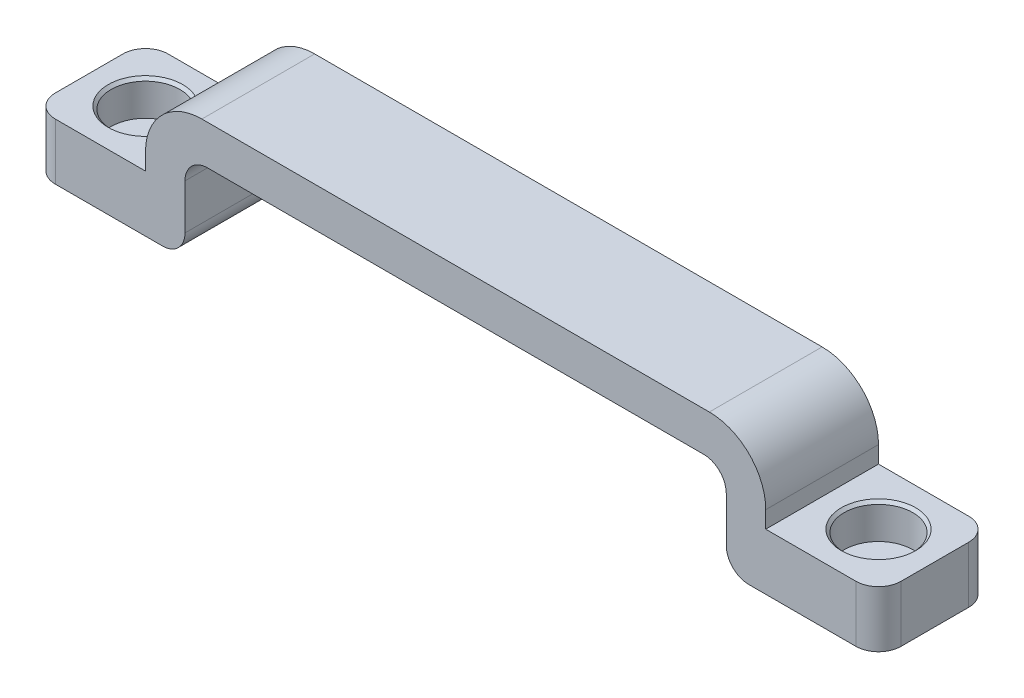
ISO-10303-21;
HEADER;
FILE_DESCRIPTION(('STEP AP214'),'2;1');
FILE_NAME('part.step','',(''),(''),'','','');
FILE_SCHEMA(('AUTOMOTIVE_DESIGN { 1 0 10303 214 1 1 1 1 }'));
ENDSEC;
DATA;
#1=APPLICATION_CONTEXT('core data for automotive mechanical design processes');
#2=APPLICATION_PROTOCOL_DEFINITION('international standard','automotive_design',2000,#1);
#3=PRODUCT_CONTEXT('',#1,'mechanical');
#4=PRODUCT('Part','Part','',(#3));
#5=PRODUCT_RELATED_PRODUCT_CATEGORY('part','',(#4));
#6=PRODUCT_DEFINITION_FORMATION('','',#4);
#7=PRODUCT_DEFINITION_CONTEXT('part definition',#1,'design');
#8=PRODUCT_DEFINITION('design','',#6,#7);
#9=PRODUCT_DEFINITION_SHAPE('','',#8);
#10=(LENGTH_UNIT() NAMED_UNIT(*) SI_UNIT(.MILLI.,.METRE.));
#11=(NAMED_UNIT(*) PLANE_ANGLE_UNIT() SI_UNIT($,.RADIAN.));
#12=(NAMED_UNIT(*) SI_UNIT($,.STERADIAN.) SOLID_ANGLE_UNIT());
#13=UNCERTAINTY_MEASURE_WITH_UNIT(LENGTH_MEASURE(1.E-05),#10,'distance_accuracy_value','');
#14=(GEOMETRIC_REPRESENTATION_CONTEXT(3) GLOBAL_UNCERTAINTY_ASSIGNED_CONTEXT((#13)) GLOBAL_UNIT_ASSIGNED_CONTEXT((#10,
#11,#12)) REPRESENTATION_CONTEXT('',''));
#15=CARTESIAN_POINT('',(0.,0.,0.));
#16=DIRECTION('',(0.,0.,1.));
#17=DIRECTION('',(1.,0.,0.));
#18=AXIS2_PLACEMENT_3D('',#15,#16,#17);
#19=CARTESIAN_POINT('',(27.5,3.5,5.));
#20=DIRECTION('',(-1.,0.,0.));
#21=DIRECTION('',(0.,0.,1.));
#22=AXIS2_PLACEMENT_3D('',#19,#20,#21);
#23=PLANE('',#22);
#24=DIRECTION('',(0.,1.,0.));
#25=VECTOR('',#24,1.);
#26=CARTESIAN_POINT('',(27.5,3.5,-5.));
#27=LINE('',#26,#25);
#28=CARTESIAN_POINT('',(27.5,-3.,-5.));
#29=VERTEX_POINT('',#28);
#30=CARTESIAN_POINT('',(27.5,-1.5,-5.));
#31=VERTEX_POINT('',#30);
#32=EDGE_CURVE('E255',#29,#31,#27,.T.);
#33=ORIENTED_EDGE('',*,*,#32,.T.);
#34=DIRECTION('',(0.,0.,-1.));
#35=VECTOR('',#34,1.);
#36=CARTESIAN_POINT('',(27.5,-1.5,5.));
#37=LINE('',#36,#35);
#38=CARTESIAN_POINT('',(27.5,-1.5,5.));
#39=VERTEX_POINT('',#38);
#40=EDGE_CURVE('E356',#31,#39,#37,.F.);
#41=ORIENTED_EDGE('',*,*,#40,.T.);
#42=DIRECTION('',(0.,1.,0.));
#43=VECTOR('',#42,1.);
#44=CARTESIAN_POINT('',(27.5,3.5,5.));
#45=LINE('',#44,#43);
#46=CARTESIAN_POINT('',(27.5,-3.,5.));
#47=VERTEX_POINT('',#46);
#48=EDGE_CURVE('E289',#47,#39,#45,.T.);
#49=ORIENTED_EDGE('',*,*,#48,.F.);
#50=DIRECTION('',(0.,0.,-1.));
#51=VECTOR('',#50,1.);
#52=CARTESIAN_POINT('',(27.5,-3.,5.));
#53=LINE('',#52,#51);
#54=EDGE_CURVE('E254',#47,#29,#53,.T.);
#55=ORIENTED_EDGE('',*,*,#54,.T.);
#56=EDGE_LOOP('',(#33,#41,#49,#55));
#57=FACE_BOUND('',#56,.T.);
#58=ADVANCED_FACE('F45',(#57),#23,.F.);
#59=CARTESIAN_POINT('',(-27.5,3.5,5.));
#60=DIRECTION('',(0.,-1.,0.));
#61=DIRECTION('',(0.,0.,-1.));
#62=AXIS2_PLACEMENT_3D('',#59,#60,#61);
#63=PLANE('',#62);
#64=DIRECTION('',(-1.,0.,0.));
#65=VECTOR('',#64,1.);
#66=CARTESIAN_POINT('',(-27.5,3.5,-5.));
#67=LINE('',#66,#65);
#68=CARTESIAN_POINT('',(22.5,3.5,-5.));
#69=VERTEX_POINT('',#68);
#70=CARTESIAN_POINT('',(-22.5,3.5,-5.));
#71=VERTEX_POINT('',#70);
#72=EDGE_CURVE('E259',#69,#71,#67,.T.);
#73=ORIENTED_EDGE('',*,*,#72,.T.);
#74=DIRECTION('',(0.,0.,-1.));
#75=VECTOR('',#74,1.);
#76=CARTESIAN_POINT('',(-22.5,3.5,5.));
#77=LINE('',#76,#75);
#78=CARTESIAN_POINT('',(-22.5,3.5,5.));
#79=VERTEX_POINT('',#78);
#80=EDGE_CURVE('E348',#71,#79,#77,.F.);
#81=ORIENTED_EDGE('',*,*,#80,.T.);
#82=DIRECTION('',(-1.,0.,0.));
#83=VECTOR('',#82,1.);
#84=CARTESIAN_POINT('',(-27.5,3.5,5.));
#85=LINE('',#84,#83);
#86=CARTESIAN_POINT('',(22.5,3.5,5.));
#87=VERTEX_POINT('',#86);
#88=EDGE_CURVE('E212',#87,#79,#85,.T.);
#89=ORIENTED_EDGE('',*,*,#88,.F.);
#90=DIRECTION('',(0.,0.,-1.));
#91=VECTOR('',#90,1.);
#92=CARTESIAN_POINT('',(22.5,3.5,5.));
#93=LINE('',#92,#91);
#94=EDGE_CURVE('E344',#87,#69,#93,.T.);
#95=ORIENTED_EDGE('',*,*,#94,.T.);
#96=EDGE_LOOP('',(#73,#81,#89,#95));
#97=FACE_BOUND('',#96,.T.);
#98=ADVANCED_FACE('F460',(#97),#63,.F.);
#99=CARTESIAN_POINT('',(-27.5,3.5,5.));
#100=DIRECTION('',(1.,0.,0.));
#101=DIRECTION('',(0.,0.,-1.));
#102=AXIS2_PLACEMENT_3D('',#99,#100,#101);
#103=PLANE('',#102);
#104=DIRECTION('',(0.,-1.,0.));
#105=VECTOR('',#104,1.);
#106=CARTESIAN_POINT('',(-27.5,3.5,5.));
#107=LINE('',#106,#105);
#108=CARTESIAN_POINT('',(-27.5,-1.5,5.));
#109=VERTEX_POINT('',#108);
#110=CARTESIAN_POINT('',(-27.5,-3.,5.));
#111=VERTEX_POINT('',#110);
#112=EDGE_CURVE('E197',#109,#111,#107,.T.);
#113=ORIENTED_EDGE('',*,*,#112,.F.);
#114=DIRECTION('',(0.,0.,-1.));
#115=VECTOR('',#114,1.);
#116=CARTESIAN_POINT('',(-27.5,-1.5,5.));
#117=LINE('',#116,#115);
#118=CARTESIAN_POINT('',(-27.5,-1.5,-5.));
#119=VERTEX_POINT('',#118);
#120=EDGE_CURVE('E335',#109,#119,#117,.T.);
#121=ORIENTED_EDGE('',*,*,#120,.T.);
#122=DIRECTION('',(0.,-1.,0.));
#123=VECTOR('',#122,1.);
#124=CARTESIAN_POINT('',(-27.5,3.5,-5.));
#125=LINE('',#124,#123);
#126=CARTESIAN_POINT('',(-27.5,-3.,-5.));
#127=VERTEX_POINT('',#126);
#128=EDGE_CURVE('E218',#119,#127,#125,.T.);
#129=ORIENTED_EDGE('',*,*,#128,.T.);
#130=DIRECTION('',(0.,0.,-1.));
#131=VECTOR('',#130,1.);
#132=CARTESIAN_POINT('',(-27.5,-3.,5.));
#133=LINE('',#132,#131);
#134=EDGE_CURVE('E215',#111,#127,#133,.T.);
#135=ORIENTED_EDGE('',*,*,#134,.F.);
#136=EDGE_LOOP('',(#113,#121,#129,#135));
#137=FACE_BOUND('',#136,.T.);
#138=ADVANCED_FACE('F216',(#137),#103,.F.);
#139=CARTESIAN_POINT('',(-27.5,-3.,5.));
#140=DIRECTION('',(0.,-1.,0.));
#141=DIRECTION('',(1.,0.,0.));
#142=AXIS2_PLACEMENT_3D('',#139,#140,#141);
#143=PLANE('',#142);
#144=CARTESIAN_POINT('',(-32.5,-3.,0.));
#145=DIRECTION('',(0.,-1.,0.));
#146=DIRECTION('',(1.,0.,0.));
#147=AXIS2_PLACEMENT_3D('',#144,#145,#146);
#148=CIRCLE('',#147,3.30000000000004);
#149=CARTESIAN_POINT('',(-29.2,-3.,0.));
#150=VERTEX_POINT('',#149);
#151=EDGE_CURVE('E439',#150,#150,#148,.T.);
#152=ORIENTED_EDGE('',*,*,#151,.T.);
#153=EDGE_LOOP('',(#152));
#154=FACE_BOUND('',#153,.T.);
#155=DIRECTION('',(-1.,0.,0.));
#156=VECTOR('',#155,1.);
#157=CARTESIAN_POINT('',(-27.5,-3.,-5.));
#158=LINE('',#157,#156);
#159=CARTESIAN_POINT('',(-35.5,-3.,-5.));
#160=VERTEX_POINT('',#159);
#161=EDGE_CURVE('E266',#127,#160,#158,.T.);
#162=ORIENTED_EDGE('',*,*,#161,.T.);
#163=CARTESIAN_POINT('',(-35.5,-3.,-3.));
#164=DIRECTION('',(0.,-1.,0.));
#165=DIRECTION('',(1.,0.,0.));
#166=AXIS2_PLACEMENT_3D('',#163,#164,#165);
#167=CIRCLE('',#166,2.);
#168=CARTESIAN_POINT('',(-37.5,-3.,-3.));
#169=VERTEX_POINT('',#168);
#170=EDGE_CURVE('E381',#160,#169,#167,.F.);
#171=ORIENTED_EDGE('',*,*,#170,.T.);
#172=DIRECTION('',(0.,0.,-1.));
#173=VECTOR('',#172,1.);
#174=CARTESIAN_POINT('',(-37.5,-3.,5.));
#175=LINE('',#174,#173);
#176=CARTESIAN_POINT('',(-37.5,-3.,3.));
#177=VERTEX_POINT('',#176);
#178=EDGE_CURVE('E224',#177,#169,#175,.T.);
#179=ORIENTED_EDGE('',*,*,#178,.F.);
#180=CARTESIAN_POINT('',(-35.5,-3.,3.));
#181=DIRECTION('',(0.,-1.,0.));
#182=DIRECTION('',(1.,0.,0.));
#183=AXIS2_PLACEMENT_3D('',#180,#181,#182);
#184=CIRCLE('',#183,2.);
#185=CARTESIAN_POINT('',(-35.5,-3.,5.));
#186=VERTEX_POINT('',#185);
#187=EDGE_CURVE('E229',#177,#186,#184,.F.);
#188=ORIENTED_EDGE('',*,*,#187,.T.);
#189=DIRECTION('',(-1.,0.,0.));
#190=VECTOR('',#189,1.);
#191=CARTESIAN_POINT('',(-27.5,-3.,5.));
#192=LINE('',#191,#190);
#193=EDGE_CURVE('E203',#111,#186,#192,.T.);
#194=ORIENTED_EDGE('',*,*,#193,.F.);
#195=ORIENTED_EDGE('',*,*,#134,.T.);
#196=EDGE_LOOP('',(#162,#171,#179,#188,#194,#195));
#197=FACE_BOUND('',#196,.T.);
#198=ADVANCED_FACE('F226',(#154,#197),#143,.F.);
#199=CARTESIAN_POINT('',(-37.5,-3.,5.));
#200=DIRECTION('',(1.,0.,0.));
#201=DIRECTION('',(0.,0.,-1.));
#202=AXIS2_PLACEMENT_3D('',#199,#200,#201);
#203=PLANE('',#202);
#204=ORIENTED_EDGE('',*,*,#178,.T.);
#205=DIRECTION('',(0.,-1.,0.));
#206=VECTOR('',#205,1.);
#207=CARTESIAN_POINT('',(-37.5,-3.,-3.));
#208=LINE('',#207,#206);
#209=CARTESIAN_POINT('',(-37.5,-8.,-3.));
#210=VERTEX_POINT('',#209);
#211=EDGE_CURVE('E362',#169,#210,#208,.T.);
#212=ORIENTED_EDGE('',*,*,#211,.T.);
#213=DIRECTION('',(0.,0.,-1.));
#214=VECTOR('',#213,1.);
#215=CARTESIAN_POINT('',(-37.5,-8.,5.));
#216=LINE('',#215,#214);
#217=CARTESIAN_POINT('',(-37.5,-8.,3.));
#218=VERTEX_POINT('',#217);
#219=EDGE_CURVE('E301',#218,#210,#216,.T.);
#220=ORIENTED_EDGE('',*,*,#219,.F.);
#221=DIRECTION('',(0.,-1.,0.));
#222=VECTOR('',#221,1.);
#223=CARTESIAN_POINT('',(-37.5,-3.,3.));
#224=LINE('',#223,#222);
#225=EDGE_CURVE('E359',#218,#177,#224,.F.);
#226=ORIENTED_EDGE('',*,*,#225,.T.);
#227=EDGE_LOOP('',(#204,#212,#220,#226));
#228=FACE_BOUND('',#227,.T.);
#229=ADVANCED_FACE('F598',(#228),#203,.F.);
#230=CARTESIAN_POINT('',(-27.5,-8.,5.));
#231=DIRECTION('',(0.,1.,0.));
#232=DIRECTION('',(0.,0.,1.));
#233=AXIS2_PLACEMENT_3D('',#230,#231,#232);
#234=PLANE('',#233);
#235=DIRECTION('',(1.,0.,0.));
#236=VECTOR('',#235,1.);
#237=CARTESIAN_POINT('',(-27.5,-8.,-5.));
#238=LINE('',#237,#236);
#239=CARTESIAN_POINT('',(-35.5,-8.,-5.));
#240=VERTEX_POINT('',#239);
#241=CARTESIAN_POINT('',(-26.,-8.,-5.));
#242=VERTEX_POINT('',#241);
#243=EDGE_CURVE('E269',#240,#242,#238,.T.);
#244=ORIENTED_EDGE('',*,*,#243,.T.);
#245=DIRECTION('',(0.,0.,-1.));
#246=VECTOR('',#245,1.);
#247=CARTESIAN_POINT('',(-26.,-8.,5.));
#248=LINE('',#247,#246);
#249=CARTESIAN_POINT('',(-26.,-8.,5.));
#250=VERTEX_POINT('',#249);
#251=EDGE_CURVE('E421',#242,#250,#248,.F.);
#252=ORIENTED_EDGE('',*,*,#251,.T.);
#253=DIRECTION('',(1.,0.,0.));
#254=VECTOR('',#253,1.);
#255=CARTESIAN_POINT('',(-27.5,-8.,5.));
#256=LINE('',#255,#254);
#257=CARTESIAN_POINT('',(-35.5,-8.,5.));
#258=VERTEX_POINT('',#257);
#259=EDGE_CURVE('E231',#258,#250,#256,.T.);
#260=ORIENTED_EDGE('',*,*,#259,.F.);
#261=CARTESIAN_POINT('',(-35.5,-8.,3.));
#262=DIRECTION('',(0.,1.,0.));
#263=DIRECTION('',(0.,0.,1.));
#264=AXIS2_PLACEMENT_3D('',#261,#262,#263);
#265=CIRCLE('',#264,2.);
#266=EDGE_CURVE('E366',#258,#218,#265,.F.);
#267=ORIENTED_EDGE('',*,*,#266,.T.);
#268=ORIENTED_EDGE('',*,*,#219,.T.);
#269=CARTESIAN_POINT('',(-35.5,-8.,-3.));
#270=DIRECTION('',(0.,1.,0.));
#271=DIRECTION('',(0.,0.,1.));
#272=AXIS2_PLACEMENT_3D('',#269,#270,#271);
#273=CIRCLE('',#272,2.);
#274=EDGE_CURVE('E369',#210,#240,#273,.F.);
#275=ORIENTED_EDGE('',*,*,#274,.T.);
#276=EDGE_LOOP('',(#244,#252,#260,#267,#268,#275));
#277=FACE_BOUND('',#276,.T.);
#278=ADVANCED_FACE('F594',(#277),#234,.F.);
#279=CARTESIAN_POINT('',(-24.,-8.,5.));
#280=DIRECTION('',(-1.,0.,0.));
#281=DIRECTION('',(0.,-1.,0.));
#282=AXIS2_PLACEMENT_3D('',#279,#280,#281);
#283=PLANE('',#282);
#284=DIRECTION('',(0.,1.,0.));
#285=VECTOR('',#284,1.);
#286=CARTESIAN_POINT('',(-24.,-8.,5.));
#287=LINE('',#286,#285);
#288=CARTESIAN_POINT('',(-24.,-6.,5.));
#289=VERTEX_POINT('',#288);
#290=CARTESIAN_POINT('',(-24.,-2.,5.));
#291=VERTEX_POINT('',#290);
#292=EDGE_CURVE('E235',#289,#291,#287,.T.);
#293=ORIENTED_EDGE('',*,*,#292,.F.);
#294=DIRECTION('',(0.,0.,-1.));
#295=VECTOR('',#294,1.);
#296=CARTESIAN_POINT('',(-24.,-6.,5.));
#297=LINE('',#296,#295);
#298=CARTESIAN_POINT('',(-24.,-6.,-5.));
#299=VERTEX_POINT('',#298);
#300=EDGE_CURVE('E411',#289,#299,#297,.T.);
#301=ORIENTED_EDGE('',*,*,#300,.T.);
#302=DIRECTION('',(0.,1.,0.));
#303=VECTOR('',#302,1.);
#304=CARTESIAN_POINT('',(-24.,-8.,-5.));
#305=LINE('',#304,#303);
#306=CARTESIAN_POINT('',(-24.,-2.,-5.));
#307=VERTEX_POINT('',#306);
#308=EDGE_CURVE('E273',#299,#307,#305,.T.);
#309=ORIENTED_EDGE('',*,*,#308,.T.);
#310=DIRECTION('',(0.,0.,-1.));
#311=VECTOR('',#310,1.);
#312=CARTESIAN_POINT('',(-24.,-2.,5.));
#313=LINE('',#312,#311);
#314=EDGE_CURVE('E314',#307,#291,#313,.F.);
#315=ORIENTED_EDGE('',*,*,#314,.T.);
#316=EDGE_LOOP('',(#293,#301,#309,#315));
#317=FACE_BOUND('',#316,.T.);
#318=ADVANCED_FACE('F590',(#317),#283,.F.);
#319=CARTESIAN_POINT('',(-24.,0.,5.));
#320=DIRECTION('',(0.,1.,0.));
#321=DIRECTION('',(0.,0.,1.));
#322=AXIS2_PLACEMENT_3D('',#319,#320,#321);
#323=PLANE('',#322);
#324=DIRECTION('',(1.,0.,0.));
#325=VECTOR('',#324,1.);
#326=CARTESIAN_POINT('',(-24.,0.,5.));
#327=LINE('',#326,#325);
#328=CARTESIAN_POINT('',(-22.,0.,5.));
#329=VERTEX_POINT('',#328);
#330=CARTESIAN_POINT('',(22.,0.,5.));
#331=VERTEX_POINT('',#330);
#332=EDGE_CURVE('E241',#329,#331,#327,.T.);
#333=ORIENTED_EDGE('',*,*,#332,.F.);
#334=DIRECTION('',(0.,0.,-1.));
#335=VECTOR('',#334,1.);
#336=CARTESIAN_POINT('',(-22.,0.,-5.));
#337=LINE('',#336,#335);
#338=CARTESIAN_POINT('',(-22.,0.,-5.));
#339=VERTEX_POINT('',#338);
#340=EDGE_CURVE('E310',#329,#339,#337,.T.);
#341=ORIENTED_EDGE('',*,*,#340,.T.);
#342=DIRECTION('',(1.,0.,0.));
#343=VECTOR('',#342,1.);
#344=CARTESIAN_POINT('',(-24.,0.,-5.));
#345=LINE('',#344,#343);
#346=CARTESIAN_POINT('',(22.,0.,-5.));
#347=VERTEX_POINT('',#346);
#348=EDGE_CURVE('E276',#339,#347,#345,.T.);
#349=ORIENTED_EDGE('',*,*,#348,.T.);
#350=DIRECTION('',(0.,0.,-1.));
#351=VECTOR('',#350,1.);
#352=CARTESIAN_POINT('',(22.,0.,5.));
#353=LINE('',#352,#351);
#354=EDGE_CURVE('E223',#347,#331,#353,.F.);
#355=ORIENTED_EDGE('',*,*,#354,.T.);
#356=EDGE_LOOP('',(#333,#341,#349,#355));
#357=FACE_BOUND('',#356,.T.);
#358=ADVANCED_FACE('F587',(#357),#323,.F.);
#359=CARTESIAN_POINT('',(24.,-8.,5.));
#360=DIRECTION('',(1.,0.,0.));
#361=DIRECTION('',(0.,1.,0.));
#362=AXIS2_PLACEMENT_3D('',#359,#360,#361);
#363=PLANE('',#362);
#364=DIRECTION('',(0.,-1.,0.));
#365=VECTOR('',#364,1.);
#366=CARTESIAN_POINT('',(24.,-8.,-5.));
#367=LINE('',#366,#365);
#368=CARTESIAN_POINT('',(24.,-2.,-5.));
#369=VERTEX_POINT('',#368);
#370=CARTESIAN_POINT('',(24.,-6.,-5.));
#371=VERTEX_POINT('',#370);
#372=EDGE_CURVE('E280',#369,#371,#367,.T.);
#373=ORIENTED_EDGE('',*,*,#372,.T.);
#374=DIRECTION('',(0.,0.,-1.));
#375=VECTOR('',#374,1.);
#376=CARTESIAN_POINT('',(24.,-6.,5.));
#377=LINE('',#376,#375);
#378=CARTESIAN_POINT('',(24.,-6.,5.));
#379=VERTEX_POINT('',#378);
#380=EDGE_CURVE('E70',#371,#379,#377,.F.);
#381=ORIENTED_EDGE('',*,*,#380,.T.);
#382=DIRECTION('',(0.,-1.,0.));
#383=VECTOR('',#382,1.);
#384=CARTESIAN_POINT('',(24.,-8.,5.));
#385=LINE('',#384,#383);
#386=CARTESIAN_POINT('',(24.,-2.,5.));
#387=VERTEX_POINT('',#386);
#388=EDGE_CURVE('E245',#387,#379,#385,.T.);
#389=ORIENTED_EDGE('',*,*,#388,.F.);
#390=DIRECTION('',(0.,0.,-1.));
#391=VECTOR('',#390,1.);
#392=CARTESIAN_POINT('',(24.,-2.,-5.));
#393=LINE('',#392,#391);
#394=EDGE_CURVE('E318',#387,#369,#393,.T.);
#395=ORIENTED_EDGE('',*,*,#394,.T.);
#396=EDGE_LOOP('',(#373,#381,#389,#395));
#397=FACE_BOUND('',#396,.T.);
#398=ADVANCED_FACE('F584',(#397),#363,.F.);
#399=CARTESIAN_POINT('',(27.5,-8.,5.));
#400=DIRECTION('',(0.,1.,0.));
#401=DIRECTION('',(-1.,0.,0.));
#402=AXIS2_PLACEMENT_3D('',#399,#400,#401);
#403=PLANE('',#402);
#404=DIRECTION('',(1.,0.,0.));
#405=VECTOR('',#404,1.);
#406=CARTESIAN_POINT('',(27.5,-8.,5.));
#407=LINE('',#406,#405);
#408=CARTESIAN_POINT('',(26.,-8.,5.));
#409=VERTEX_POINT('',#408);
#410=CARTESIAN_POINT('',(35.5,-8.,5.));
#411=VERTEX_POINT('',#410);
#412=EDGE_CURVE('E248',#409,#411,#407,.T.);
#413=ORIENTED_EDGE('',*,*,#412,.F.);
#414=DIRECTION('',(0.,0.,-1.));
#415=VECTOR('',#414,1.);
#416=CARTESIAN_POINT('',(26.,-8.,5.));
#417=LINE('',#416,#415);
#418=CARTESIAN_POINT('',(26.,-8.,-5.));
#419=VERTEX_POINT('',#418);
#420=EDGE_CURVE('E429',#409,#419,#417,.T.);
#421=ORIENTED_EDGE('',*,*,#420,.T.);
#422=DIRECTION('',(1.,0.,0.));
#423=VECTOR('',#422,1.);
#424=CARTESIAN_POINT('',(27.5,-8.,-5.));
#425=LINE('',#424,#423);
#426=CARTESIAN_POINT('',(35.5,-8.,-5.));
#427=VERTEX_POINT('',#426);
#428=EDGE_CURVE('E283',#419,#427,#425,.T.);
#429=ORIENTED_EDGE('',*,*,#428,.T.);
#430=CARTESIAN_POINT('',(35.5,-8.,-3.));
#431=DIRECTION('',(0.,1.,0.));
#432=DIRECTION('',(-1.,0.,0.));
#433=AXIS2_PLACEMENT_3D('',#430,#431,#432);
#434=CIRCLE('',#433,2.);
#435=CARTESIAN_POINT('',(37.5,-8.,-3.));
#436=VERTEX_POINT('',#435);
#437=EDGE_CURVE('E408',#427,#436,#434,.F.);
#438=ORIENTED_EDGE('',*,*,#437,.T.);
#439=DIRECTION('',(0.,0.,-1.));
#440=VECTOR('',#439,1.);
#441=CARTESIAN_POINT('',(37.5,-8.,5.));
#442=LINE('',#441,#440);
#443=CARTESIAN_POINT('',(37.5,-8.,3.));
#444=VERTEX_POINT('',#443);
#445=EDGE_CURVE('E297',#444,#436,#442,.T.);
#446=ORIENTED_EDGE('',*,*,#445,.F.);
#447=CARTESIAN_POINT('',(35.5,-8.,3.));
#448=DIRECTION('',(0.,1.,0.));
#449=DIRECTION('',(-1.,0.,0.));
#450=AXIS2_PLACEMENT_3D('',#447,#448,#449);
#451=CIRCLE('',#450,2.);
#452=EDGE_CURVE('E404',#444,#411,#451,.F.);
#453=ORIENTED_EDGE('',*,*,#452,.T.);
#454=EDGE_LOOP('',(#413,#421,#429,#438,#446,#453));
#455=FACE_BOUND('',#454,.T.);
#456=ADVANCED_FACE('F524',(#455),#403,.F.);
#457=CARTESIAN_POINT('',(37.5,-3.,5.));
#458=DIRECTION('',(-1.,0.,0.));
#459=DIRECTION('',(0.,0.,1.));
#460=AXIS2_PLACEMENT_3D('',#457,#458,#459);
#461=PLANE('',#460);
#462=ORIENTED_EDGE('',*,*,#445,.T.);
#463=DIRECTION('',(0.,1.,0.));
#464=VECTOR('',#463,1.);
#465=CARTESIAN_POINT('',(37.5,-3.,-3.));
#466=LINE('',#465,#464);
#467=CARTESIAN_POINT('',(37.5,-3.,-3.));
#468=VERTEX_POINT('',#467);
#469=EDGE_CURVE('E394',#436,#468,#466,.T.);
#470=ORIENTED_EDGE('',*,*,#469,.T.);
#471=DIRECTION('',(0.,0.,-1.));
#472=VECTOR('',#471,1.);
#473=CARTESIAN_POINT('',(37.5,-3.,5.));
#474=LINE('',#473,#472);
#475=CARTESIAN_POINT('',(37.5,-3.,3.));
#476=VERTEX_POINT('',#475);
#477=EDGE_CURVE('E293',#476,#468,#474,.T.);
#478=ORIENTED_EDGE('',*,*,#477,.F.);
#479=DIRECTION('',(0.,1.,0.));
#480=VECTOR('',#479,1.);
#481=CARTESIAN_POINT('',(37.5,-8.,3.));
#482=LINE('',#481,#480);
#483=EDGE_CURVE('E391',#476,#444,#482,.F.);
#484=ORIENTED_EDGE('',*,*,#483,.T.);
#485=EDGE_LOOP('',(#462,#470,#478,#484));
#486=FACE_BOUND('',#485,.T.);
#487=ADVANCED_FACE('F536',(#486),#461,.F.);
#488=CARTESIAN_POINT('',(27.5,-3.,5.));
#489=DIRECTION('',(0.,-1.,0.));
#490=DIRECTION('',(1.,0.,0.));
#491=AXIS2_PLACEMENT_3D('',#488,#489,#490);
#492=PLANE('',#491);
#493=CARTESIAN_POINT('',(32.5,-3.,0.));
#494=DIRECTION('',(0.,-1.,0.));
#495=DIRECTION('',(1.,0.,0.));
#496=AXIS2_PLACEMENT_3D('',#493,#494,#495);
#497=CIRCLE('',#496,3.30000000000003);
#498=CARTESIAN_POINT('',(35.8,-3.,0.));
#499=VERTEX_POINT('',#498);
#500=EDGE_CURVE('E11',#499,#499,#497,.T.);
#501=ORIENTED_EDGE('',*,*,#500,.T.);
#502=EDGE_LOOP('',(#501));
#503=FACE_BOUND('',#502,.T.);
#504=ORIENTED_EDGE('',*,*,#477,.T.);
#505=CARTESIAN_POINT('',(35.5,-3.,-3.));
#506=DIRECTION('',(0.,-1.,0.));
#507=DIRECTION('',(1.,0.,0.));
#508=AXIS2_PLACEMENT_3D('',#505,#506,#507);
#509=CIRCLE('',#508,2.);
#510=CARTESIAN_POINT('',(35.5,-3.,-5.));
#511=VERTEX_POINT('',#510);
#512=EDGE_CURVE('E401',#468,#511,#509,.F.);
#513=ORIENTED_EDGE('',*,*,#512,.T.);
#514=DIRECTION('',(-1.,0.,0.));
#515=VECTOR('',#514,1.);
#516=CARTESIAN_POINT('',(27.5,-3.,-5.));
#517=LINE('',#516,#515);
#518=EDGE_CURVE('E286',#511,#29,#517,.T.);
#519=ORIENTED_EDGE('',*,*,#518,.T.);
#520=ORIENTED_EDGE('',*,*,#54,.F.);
#521=DIRECTION('',(-1.,0.,0.));
#522=VECTOR('',#521,1.);
#523=CARTESIAN_POINT('',(27.5,-3.,5.));
#524=LINE('',#523,#522);
#525=CARTESIAN_POINT('',(35.5,-3.,5.));
#526=VERTEX_POINT('',#525);
#527=EDGE_CURVE('E251',#526,#47,#524,.T.);
#528=ORIENTED_EDGE('',*,*,#527,.F.);
#529=CARTESIAN_POINT('',(35.5,-3.,3.));
#530=DIRECTION('',(0.,-1.,0.));
#531=DIRECTION('',(1.,0.,0.));
#532=AXIS2_PLACEMENT_3D('',#529,#530,#531);
#533=CIRCLE('',#532,2.);
#534=EDGE_CURVE('E398',#526,#476,#533,.F.);
#535=ORIENTED_EDGE('',*,*,#534,.T.);
#536=EDGE_LOOP('',(#504,#513,#519,#520,#528,#535));
#537=FACE_BOUND('',#536,.T.);
#538=ADVANCED_FACE('F544',(#503,#537),#492,.F.);
#539=CARTESIAN_POINT('',(0.,0.,5.));
#540=DIRECTION('',(0.,0.,1.));
#541=DIRECTION('',(1.,0.,0.));
#542=AXIS2_PLACEMENT_3D('',#539,#540,#541);
#543=PLANE('',#542);
#544=ORIENTED_EDGE('',*,*,#259,.T.);
#545=CARTESIAN_POINT('',(-26.,-6.,5.));
#546=DIRECTION('',(0.,0.,1.));
#547=DIRECTION('',(1.,0.,0.));
#548=AXIS2_PLACEMENT_3D('',#545,#546,#547);
#549=CIRCLE('',#548,2.);
#550=EDGE_CURVE('E426',#250,#289,#549,.T.);
#551=ORIENTED_EDGE('',*,*,#550,.T.);
#552=ORIENTED_EDGE('',*,*,#292,.T.);
#553=CARTESIAN_POINT('',(-22.,-2.,5.));
#554=DIRECTION('',(0.,0.,1.));
#555=DIRECTION('',(1.,0.,0.));
#556=AXIS2_PLACEMENT_3D('',#553,#554,#555);
#557=CIRCLE('',#556,2.);
#558=EDGE_CURVE('E326',#291,#329,#557,.F.);
#559=ORIENTED_EDGE('',*,*,#558,.T.);
#560=ORIENTED_EDGE('',*,*,#332,.T.);
#561=CARTESIAN_POINT('',(22.,-2.,5.));
#562=DIRECTION('',(0.,0.,1.));
#563=DIRECTION('',(1.,0.,0.));
#564=AXIS2_PLACEMENT_3D('',#561,#562,#563);
#565=CIRCLE('',#564,2.);
#566=EDGE_CURVE('E332',#331,#387,#565,.F.);
#567=ORIENTED_EDGE('',*,*,#566,.T.);
#568=ORIENTED_EDGE('',*,*,#388,.T.);
#569=CARTESIAN_POINT('',(26.,-6.,5.));
#570=DIRECTION('',(0.,0.,1.));
#571=DIRECTION('',(1.,0.,0.));
#572=AXIS2_PLACEMENT_3D('',#569,#570,#571);
#573=CIRCLE('',#572,2.);
#574=EDGE_CURVE('E62',#379,#409,#573,.T.);
#575=ORIENTED_EDGE('',*,*,#574,.T.);
#576=ORIENTED_EDGE('',*,*,#412,.T.);
#577=DIRECTION('',(0.,1.,0.));
#578=VECTOR('',#577,1.);
#579=CARTESIAN_POINT('',(35.5,-3.,5.));
#580=LINE('',#579,#578);
#581=EDGE_CURVE('E384',#411,#526,#580,.T.);
#582=ORIENTED_EDGE('',*,*,#581,.T.);
#583=ORIENTED_EDGE('',*,*,#527,.T.);
#584=ORIENTED_EDGE('',*,*,#48,.T.);
#585=CARTESIAN_POINT('',(22.5,-1.5,5.));
#586=DIRECTION('',(0.,0.,1.));
#587=DIRECTION('',(1.,0.,0.));
#588=AXIS2_PLACEMENT_3D('',#585,#586,#587);
#589=CIRCLE('',#588,5.);
#590=EDGE_CURVE('E351',#39,#87,#589,.T.);
#591=ORIENTED_EDGE('',*,*,#590,.T.);
#592=ORIENTED_EDGE('',*,*,#88,.T.);
#593=CARTESIAN_POINT('',(-22.5,-1.5,5.));
#594=DIRECTION('',(0.,0.,1.));
#595=DIRECTION('',(1.,0.,0.));
#596=AXIS2_PLACEMENT_3D('',#593,#594,#595);
#597=CIRCLE('',#596,5.);
#598=EDGE_CURVE('E207',#79,#109,#597,.T.);
#599=ORIENTED_EDGE('',*,*,#598,.T.);
#600=ORIENTED_EDGE('',*,*,#112,.T.);
#601=ORIENTED_EDGE('',*,*,#193,.T.);
#602=DIRECTION('',(0.,-1.,0.));
#603=VECTOR('',#602,1.);
#604=CARTESIAN_POINT('',(-35.5,-8.,5.));
#605=LINE('',#604,#603);
#606=EDGE_CURVE('E388',#186,#258,#605,.T.);
#607=ORIENTED_EDGE('',*,*,#606,.T.);
#608=EDGE_LOOP('',(#544,#551,#552,#559,#560,#567,#568,#575,#576,#582,#583,#584,#591,#592,#599,
#600,#601,#607));
#609=FACE_BOUND('',#608,.T.);
#610=ADVANCED_FACE('F200',(#609),#543,.T.);
#611=CARTESIAN_POINT('',(0.,0.,-5.));
#612=DIRECTION('',(0.,0.,1.));
#613=DIRECTION('',(1.,0.,0.));
#614=AXIS2_PLACEMENT_3D('',#611,#612,#613);
#615=PLANE('',#614);
#616=ORIENTED_EDGE('',*,*,#308,.F.);
#617=CARTESIAN_POINT('',(-26.,-6.,-5.));
#618=DIRECTION('',(0.,0.,1.));
#619=DIRECTION('',(1.,0.,0.));
#620=AXIS2_PLACEMENT_3D('',#617,#618,#619);
#621=CIRCLE('',#620,2.);
#622=EDGE_CURVE('E418',#299,#242,#621,.F.);
#623=ORIENTED_EDGE('',*,*,#622,.T.);
#624=ORIENTED_EDGE('',*,*,#243,.F.);
#625=DIRECTION('',(0.,-1.,0.));
#626=VECTOR('',#625,1.);
#627=CARTESIAN_POINT('',(-35.5,0.,-5.));
#628=LINE('',#627,#626);
#629=EDGE_CURVE('E376',#240,#160,#628,.F.);
#630=ORIENTED_EDGE('',*,*,#629,.T.);
#631=ORIENTED_EDGE('',*,*,#161,.F.);
#632=ORIENTED_EDGE('',*,*,#128,.F.);
#633=CARTESIAN_POINT('',(-22.5,-1.5,-5.));
#634=DIRECTION('',(0.,0.,1.));
#635=DIRECTION('',(1.,0.,0.));
#636=AXIS2_PLACEMENT_3D('',#633,#634,#635);
#637=CIRCLE('',#636,5.);
#638=EDGE_CURVE('E341',#119,#71,#637,.F.);
#639=ORIENTED_EDGE('',*,*,#638,.T.);
#640=ORIENTED_EDGE('',*,*,#72,.F.);
#641=CARTESIAN_POINT('',(22.5,-1.5,-5.));
#642=DIRECTION('',(0.,0.,1.));
#643=DIRECTION('',(1.,0.,0.));
#644=AXIS2_PLACEMENT_3D('',#641,#642,#643);
#645=CIRCLE('',#644,5.);
#646=EDGE_CURVE('E338',#69,#31,#645,.F.);
#647=ORIENTED_EDGE('',*,*,#646,.T.);
#648=ORIENTED_EDGE('',*,*,#32,.F.);
#649=ORIENTED_EDGE('',*,*,#518,.F.);
#650=DIRECTION('',(0.,1.,0.));
#651=VECTOR('',#650,1.);
#652=CARTESIAN_POINT('',(35.5,0.,-5.));
#653=LINE('',#652,#651);
#654=EDGE_CURVE('E372',#511,#427,#653,.F.);
#655=ORIENTED_EDGE('',*,*,#654,.T.);
#656=ORIENTED_EDGE('',*,*,#428,.F.);
#657=CARTESIAN_POINT('',(26.,-6.,-5.));
#658=DIRECTION('',(0.,0.,1.));
#659=DIRECTION('',(1.,0.,0.));
#660=AXIS2_PLACEMENT_3D('',#657,#658,#659);
#661=CIRCLE('',#660,2.);
#662=EDGE_CURVE('E415',#419,#371,#661,.F.);
#663=ORIENTED_EDGE('',*,*,#662,.T.);
#664=ORIENTED_EDGE('',*,*,#372,.F.);
#665=CARTESIAN_POINT('',(22.,-2.,-5.));
#666=DIRECTION('',(0.,0.,1.));
#667=DIRECTION('',(1.,0.,0.));
#668=AXIS2_PLACEMENT_3D('',#665,#666,#667);
#669=CIRCLE('',#668,2.);
#670=EDGE_CURVE('E329',#369,#347,#669,.T.);
#671=ORIENTED_EDGE('',*,*,#670,.T.);
#672=ORIENTED_EDGE('',*,*,#348,.F.);
#673=CARTESIAN_POINT('',(-22.,-2.,-5.));
#674=DIRECTION('',(0.,0.,1.));
#675=DIRECTION('',(1.,0.,0.));
#676=AXIS2_PLACEMENT_3D('',#673,#674,#675);
#677=CIRCLE('',#676,2.);
#678=EDGE_CURVE('E322',#339,#307,#677,.T.);
#679=ORIENTED_EDGE('',*,*,#678,.T.);
#680=EDGE_LOOP('',(#616,#623,#624,#630,#631,#632,#639,#640,#647,#648,#649,#655,#656,#663,#664,
#671,#672,#679));
#681=FACE_BOUND('',#680,.T.);
#682=ADVANCED_FACE('F475',(#681),#615,.F.);
#683=CARTESIAN_POINT('',(-22.,-2.,5.));
#684=DIRECTION('',(0.,0.,1.));
#685=DIRECTION('',(1.,0.,0.));
#686=AXIS2_PLACEMENT_3D('',#683,#684,#685);
#687=CYLINDRICAL_SURFACE('',#686,2.);
#688=ORIENTED_EDGE('',*,*,#558,.F.);
#689=ORIENTED_EDGE('',*,*,#314,.F.);
#690=ORIENTED_EDGE('',*,*,#678,.F.);
#691=ORIENTED_EDGE('',*,*,#340,.F.);
#692=EDGE_LOOP('',(#688,#689,#690,#691));
#693=FACE_BOUND('',#692,.T.);
#694=ADVANCED_FACE('F471',(#693),#687,.F.);
#695=CARTESIAN_POINT('',(22.,-2.,5.));
#696=DIRECTION('',(0.,0.,1.));
#697=DIRECTION('',(1.,0.,0.));
#698=AXIS2_PLACEMENT_3D('',#695,#696,#697);
#699=CYLINDRICAL_SURFACE('',#698,2.);
#700=ORIENTED_EDGE('',*,*,#566,.F.);
#701=ORIENTED_EDGE('',*,*,#354,.F.);
#702=ORIENTED_EDGE('',*,*,#670,.F.);
#703=ORIENTED_EDGE('',*,*,#394,.F.);
#704=EDGE_LOOP('',(#700,#701,#702,#703));
#705=FACE_BOUND('',#704,.T.);
#706=ADVANCED_FACE('F474',(#705),#699,.F.);
#707=CARTESIAN_POINT('',(-22.5,-1.5,5.));
#708=DIRECTION('',(0.,0.,-1.));
#709=DIRECTION('',(-1.,0.,0.));
#710=AXIS2_PLACEMENT_3D('',#707,#708,#709);
#711=CYLINDRICAL_SURFACE('',#710,5.);
#712=ORIENTED_EDGE('',*,*,#598,.F.);
#713=ORIENTED_EDGE('',*,*,#80,.F.);
#714=ORIENTED_EDGE('',*,*,#638,.F.);
#715=ORIENTED_EDGE('',*,*,#120,.F.);
#716=EDGE_LOOP('',(#712,#713,#714,#715));
#717=FACE_BOUND('',#716,.T.);
#718=ADVANCED_FACE('F478',(#717),#711,.T.);
#719=CARTESIAN_POINT('',(22.5,-1.5,5.));
#720=DIRECTION('',(0.,0.,-1.));
#721=DIRECTION('',(-1.,0.,0.));
#722=AXIS2_PLACEMENT_3D('',#719,#720,#721);
#723=CYLINDRICAL_SURFACE('',#722,5.);
#724=ORIENTED_EDGE('',*,*,#590,.F.);
#725=ORIENTED_EDGE('',*,*,#40,.F.);
#726=ORIENTED_EDGE('',*,*,#646,.F.);
#727=ORIENTED_EDGE('',*,*,#94,.F.);
#728=EDGE_LOOP('',(#724,#725,#726,#727));
#729=FACE_BOUND('',#728,.T.);
#730=ADVANCED_FACE('F482',(#729),#723,.T.);
#731=CARTESIAN_POINT('',(-35.5,-3.,-3.));
#732=DIRECTION('',(0.,-1.,0.));
#733=DIRECTION('',(0.,0.,-1.));
#734=AXIS2_PLACEMENT_3D('',#731,#732,#733);
#735=CYLINDRICAL_SURFACE('',#734,2.);
#736=ORIENTED_EDGE('',*,*,#170,.F.);
#737=ORIENTED_EDGE('',*,*,#629,.F.);
#738=ORIENTED_EDGE('',*,*,#274,.F.);
#739=ORIENTED_EDGE('',*,*,#211,.F.);
#740=EDGE_LOOP('',(#736,#737,#738,#739));
#741=FACE_BOUND('',#740,.T.);
#742=ADVANCED_FACE('F486',(#741),#735,.T.);
#743=CARTESIAN_POINT('',(-35.5,0.,3.));
#744=DIRECTION('',(0.,1.,0.));
#745=DIRECTION('',(0.,0.,1.));
#746=AXIS2_PLACEMENT_3D('',#743,#744,#745);
#747=CYLINDRICAL_SURFACE('',#746,2.);
#748=ORIENTED_EDGE('',*,*,#187,.F.);
#749=ORIENTED_EDGE('',*,*,#225,.F.);
#750=ORIENTED_EDGE('',*,*,#266,.F.);
#751=ORIENTED_EDGE('',*,*,#606,.F.);
#752=EDGE_LOOP('',(#748,#749,#750,#751));
#753=FACE_BOUND('',#752,.T.);
#754=ADVANCED_FACE('F490',(#753),#747,.T.);
#755=CARTESIAN_POINT('',(35.5,-3.,-3.));
#756=DIRECTION('',(0.,1.,0.));
#757=DIRECTION('',(0.,0.,1.));
#758=AXIS2_PLACEMENT_3D('',#755,#756,#757);
#759=CYLINDRICAL_SURFACE('',#758,2.);
#760=ORIENTED_EDGE('',*,*,#437,.F.);
#761=ORIENTED_EDGE('',*,*,#654,.F.);
#762=ORIENTED_EDGE('',*,*,#512,.F.);
#763=ORIENTED_EDGE('',*,*,#469,.F.);
#764=EDGE_LOOP('',(#760,#761,#762,#763));
#765=FACE_BOUND('',#764,.T.);
#766=ADVANCED_FACE('F494',(#765),#759,.T.);
#767=CARTESIAN_POINT('',(35.5,0.,3.));
#768=DIRECTION('',(0.,-1.,0.));
#769=DIRECTION('',(0.,0.,-1.));
#770=AXIS2_PLACEMENT_3D('',#767,#768,#769);
#771=CYLINDRICAL_SURFACE('',#770,2.);
#772=ORIENTED_EDGE('',*,*,#452,.F.);
#773=ORIENTED_EDGE('',*,*,#483,.F.);
#774=ORIENTED_EDGE('',*,*,#534,.F.);
#775=ORIENTED_EDGE('',*,*,#581,.F.);
#776=EDGE_LOOP('',(#772,#773,#774,#775));
#777=FACE_BOUND('',#776,.T.);
#778=ADVANCED_FACE('F498',(#777),#771,.T.);
#779=CARTESIAN_POINT('',(-26.,-6.,5.));
#780=DIRECTION('',(0.,0.,-1.));
#781=DIRECTION('',(-1.,0.,0.));
#782=AXIS2_PLACEMENT_3D('',#779,#780,#781);
#783=CYLINDRICAL_SURFACE('',#782,2.);
#784=ORIENTED_EDGE('',*,*,#550,.F.);
#785=ORIENTED_EDGE('',*,*,#251,.F.);
#786=ORIENTED_EDGE('',*,*,#622,.F.);
#787=ORIENTED_EDGE('',*,*,#300,.F.);
#788=EDGE_LOOP('',(#784,#785,#786,#787));
#789=FACE_BOUND('',#788,.T.);
#790=ADVANCED_FACE('F502',(#789),#783,.T.);
#791=CARTESIAN_POINT('',(26.,-6.,5.));
#792=DIRECTION('',(0.,0.,-1.));
#793=DIRECTION('',(-1.,0.,0.));
#794=AXIS2_PLACEMENT_3D('',#791,#792,#793);
#795=CYLINDRICAL_SURFACE('',#794,2.);
#796=ORIENTED_EDGE('',*,*,#574,.F.);
#797=ORIENTED_EDGE('',*,*,#380,.F.);
#798=ORIENTED_EDGE('',*,*,#662,.F.);
#799=ORIENTED_EDGE('',*,*,#420,.F.);
#800=EDGE_LOOP('',(#796,#797,#798,#799));
#801=FACE_BOUND('',#800,.T.);
#802=ADVANCED_FACE('F506',(#801),#795,.T.);
#803=CARTESIAN_POINT('',(32.5,-6.1,0.));
#804=DIRECTION('',(0.,1.,0.));
#805=DIRECTION('',(-1.,0.,0.));
#806=AXIS2_PLACEMENT_3D('',#803,#804,#805);
#807=CYLINDRICAL_SURFACE('',#806,3.05);
#808=CARTESIAN_POINT('',(32.5,-3.25000000000003,0.));
#809=DIRECTION('',(0.,-1.,0.));
#810=DIRECTION('',(0.,0.,-1.));
#811=AXIS2_PLACEMENT_3D('',#808,#809,#810);
#812=CIRCLE('',#811,3.05);
#813=CARTESIAN_POINT('',(32.5,-3.25000000000003,-3.05));
#814=VERTEX_POINT('',#813);
#815=EDGE_CURVE('E55',#814,#814,#812,.F.);
#816=ORIENTED_EDGE('',*,*,#815,.T.);
#817=EDGE_LOOP('',(#816));
#818=FACE_BOUND('',#817,.T.);
#819=CARTESIAN_POINT('',(32.5,-6.1,0.));
#820=DIRECTION('',(0.,1.,0.));
#821=DIRECTION('',(-1.,0.,0.));
#822=AXIS2_PLACEMENT_3D('',#819,#820,#821);
#823=CIRCLE('',#822,3.05);
#824=CARTESIAN_POINT('',(29.45,-6.1,0.));
#825=VERTEX_POINT('',#824);
#826=EDGE_CURVE('E260',#825,#825,#823,.T.);
#827=ORIENTED_EDGE('',*,*,#826,.F.);
#828=EDGE_LOOP('',(#827));
#829=FACE_BOUND('',#828,.T.);
#830=ADVANCED_FACE('F447',(#818,#829),#807,.F.);
#831=CARTESIAN_POINT('',(32.5,-6.1,0.));
#832=DIRECTION('',(0.,1.,0.));
#833=DIRECTION('',(-1.,0.,0.));
#834=AXIS2_PLACEMENT_3D('',#831,#832,#833);
#835=PLANE('',#834);
#836=ORIENTED_EDGE('',*,*,#826,.T.);
#837=EDGE_LOOP('',(#836));
#838=FACE_BOUND('',#837,.T.);
#839=ADVANCED_FACE('F519',(#838),#835,.T.);
#840=CARTESIAN_POINT('',(-32.5,-6.10000000000001,0.));
#841=DIRECTION('',(0.,1.,0.));
#842=DIRECTION('',(-1.,0.,0.));
#843=AXIS2_PLACEMENT_3D('',#840,#841,#842);
#844=CYLINDRICAL_SURFACE('',#843,3.05);
#845=CARTESIAN_POINT('',(-32.5,-3.25000000000003,0.));
#846=DIRECTION('',(0.,-1.,0.));
#847=DIRECTION('',(0.,0.,-1.));
#848=AXIS2_PLACEMENT_3D('',#845,#846,#847);
#849=CIRCLE('',#848,3.05);
#850=CARTESIAN_POINT('',(-32.5,-3.25000000000003,-3.05));
#851=VERTEX_POINT('',#850);
#852=EDGE_CURVE('E435',#851,#851,#849,.F.);
#853=ORIENTED_EDGE('',*,*,#852,.T.);
#854=EDGE_LOOP('',(#853));
#855=FACE_BOUND('',#854,.T.);
#856=CARTESIAN_POINT('',(-32.5,-6.10000000000001,0.));
#857=DIRECTION('',(0.,1.,0.));
#858=DIRECTION('',(-1.,0.,0.));
#859=AXIS2_PLACEMENT_3D('',#856,#857,#858);
#860=CIRCLE('',#859,3.05);
#861=CARTESIAN_POINT('',(-35.55,-6.10000000000001,0.));
#862=VERTEX_POINT('',#861);
#863=EDGE_CURVE('E553',#862,#862,#860,.T.);
#864=ORIENTED_EDGE('',*,*,#863,.F.);
#865=EDGE_LOOP('',(#864));
#866=FACE_BOUND('',#865,.T.);
#867=ADVANCED_FACE('F562',(#855,#866),#844,.F.);
#868=CARTESIAN_POINT('',(-32.5,-6.10000000000001,0.));
#869=DIRECTION('',(0.,1.,0.));
#870=DIRECTION('',(-1.,0.,0.));
#871=AXIS2_PLACEMENT_3D('',#868,#869,#870);
#872=PLANE('',#871);
#873=ORIENTED_EDGE('',*,*,#863,.T.);
#874=EDGE_LOOP('',(#873));
#875=FACE_BOUND('',#874,.T.);
#876=ADVANCED_FACE('F456',(#875),#872,.T.);
#877=CARTESIAN_POINT('',(-32.5,-3.25000000000003,0.));
#878=DIRECTION('',(0.,1.,0.));
#879=DIRECTION('',(0.,0.,1.));
#880=AXIS2_PLACEMENT_3D('',#877,#878,#879);
#881=CONICAL_SURFACE('',#880,3.05,0.785398163397449);
#882=ORIENTED_EDGE('',*,*,#151,.F.);
#883=EDGE_LOOP('',(#882));
#884=FACE_BOUND('',#883,.T.);
#885=ORIENTED_EDGE('',*,*,#852,.F.);
#886=EDGE_LOOP('',(#885));
#887=FACE_BOUND('',#886,.T.);
#888=ADVANCED_FACE('F451',(#884,#887),#881,.F.);
#889=CARTESIAN_POINT('',(32.5,-3.25000000000003,0.));
#890=DIRECTION('',(0.,1.,0.));
#891=DIRECTION('',(0.,0.,1.));
#892=AXIS2_PLACEMENT_3D('',#889,#890,#891);
#893=CONICAL_SURFACE('',#892,3.05,0.785398163397441);
#894=ORIENTED_EDGE('',*,*,#500,.F.);
#895=EDGE_LOOP('',(#894));
#896=FACE_BOUND('',#895,.T.);
#897=ORIENTED_EDGE('',*,*,#815,.F.);
#898=EDGE_LOOP('',(#897));
#899=FACE_BOUND('',#898,.T.);
#900=ADVANCED_FACE('F48',(#896,#899),#893,.F.);
#901=CLOSED_SHELL('',(#58,#98,#138,#198,#229,#278,#318,#358,#398,#456,#487,#538,#610,#682,#694,
#706,#718,#730,#742,#754,#766,#778,#790,#802,#830,#839,#867,#876,#888,#900));
#902=MANIFOLD_SOLID_BREP('B2',#901);
#903=ADVANCED_BREP_SHAPE_REPRESENTATION('',(#18,#902),#14);
#904=SHAPE_DEFINITION_REPRESENTATION(#9,#903);
ENDSEC;
END-ISO-10303-21;
